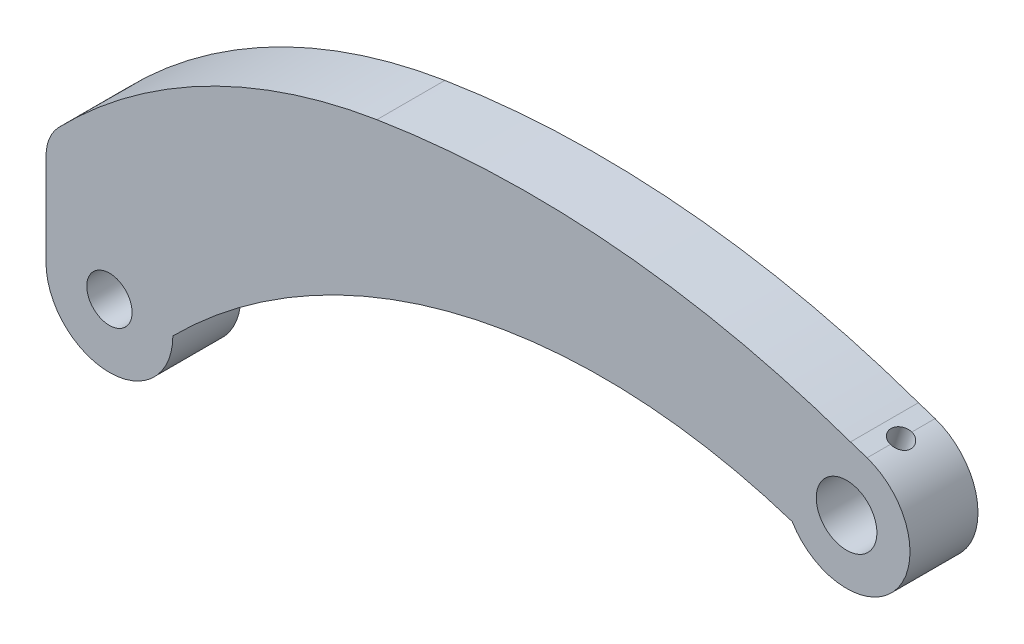
ISO-10303-21;
HEADER;
FILE_DESCRIPTION(('STEP AP214'),'2;1');
FILE_NAME('part.step','',(''),(''),'','','');
FILE_SCHEMA(('AUTOMOTIVE_DESIGN { 1 0 10303 214 1 1 1 1 }'));
ENDSEC;
DATA;
#1=APPLICATION_CONTEXT('core data for automotive mechanical design processes');
#2=APPLICATION_PROTOCOL_DEFINITION('international standard','automotive_design',2000,#1);
#3=PRODUCT_CONTEXT('',#1,'mechanical');
#4=PRODUCT('Part','Part','',(#3));
#5=PRODUCT_RELATED_PRODUCT_CATEGORY('part','',(#4));
#6=PRODUCT_DEFINITION_FORMATION('','',#4);
#7=PRODUCT_DEFINITION_CONTEXT('part definition',#1,'design');
#8=PRODUCT_DEFINITION('design','',#6,#7);
#9=PRODUCT_DEFINITION_SHAPE('','',#8);
#10=(LENGTH_UNIT() NAMED_UNIT(*) SI_UNIT(.MILLI.,.METRE.));
#11=(NAMED_UNIT(*) PLANE_ANGLE_UNIT() SI_UNIT($,.RADIAN.));
#12=(NAMED_UNIT(*) SI_UNIT($,.STERADIAN.) SOLID_ANGLE_UNIT());
#13=UNCERTAINTY_MEASURE_WITH_UNIT(LENGTH_MEASURE(1.E-05),#10,'distance_accuracy_value','');
#14=(GEOMETRIC_REPRESENTATION_CONTEXT(3) GLOBAL_UNCERTAINTY_ASSIGNED_CONTEXT((#13)) GLOBAL_UNIT_ASSIGNED_CONTEXT((#10,
#11,#12)) REPRESENTATION_CONTEXT('',''));
#15=CARTESIAN_POINT('',(0.,0.,0.));
#16=DIRECTION('',(0.,0.,1.));
#17=DIRECTION('',(1.,0.,0.));
#18=AXIS2_PLACEMENT_3D('',#15,#16,#17);
#19=CARTESIAN_POINT('',(23.7460808958069,-140.29031019522,0.));
#20=DIRECTION('',(0.309317373994585,0.950958864591468,0.));
#21=DIRECTION('',(-0.950958864591468,0.309317373994585,0.));
#22=AXIS2_PLACEMENT_3D('',#19,#20,#21);
#23=CYLINDRICAL_SURFACE('',#22,1.5);
#24=CARTESIAN_POINT('',(47.3285287994342,-67.7889256363516,-1.50000000000001));
#25=CARTESIAN_POINT('',(47.3682303350276,-67.8025109764546,-1.50000006487762));
#26=CARTESIAN_POINT('',(47.407815026627,-67.8163742276622,-1.49823853545064));
#27=CARTESIAN_POINT('',(47.4865049498814,-67.8445538739273,-1.4912156476978));
#28=CARTESIAN_POINT('',(47.5256102334144,-67.858870219343,-1.48595467152234));
#29=CARTESIAN_POINT('',(47.6416818857849,-67.9022860648032,-1.46498764472187));
#30=CARTESIAN_POINT('',(47.7175798313425,-67.9319126898596,-1.44409726018458));
#31=CARTESIAN_POINT('',(47.8642977383525,-67.9914094850627,-1.38912726676771));
#32=CARTESIAN_POINT('',(47.9351167127341,-68.0212797013005,-1.35504510232548));
#33=CARTESIAN_POINT('',(48.0699157365782,-68.0800420108765,-1.27468467640612));
#34=CARTESIAN_POINT('',(48.1338958356743,-68.1089341113124,-1.22840650345083));
#35=CARTESIAN_POINT('',(48.2540301234609,-68.1647096546514,-1.1244461105386));
#36=CARTESIAN_POINT('',(48.310104390702,-68.1915714640551,-1.0666599603315));
#37=CARTESIAN_POINT('',(48.4123779747691,-68.2416765290343,-0.941521687238114));
#38=CARTESIAN_POINT('',(48.4585736556197,-68.264918451399,-0.87416605727798));
#39=CARTESIAN_POINT('',(48.5401818677253,-68.3066716751952,-0.731334637767884));
#40=CARTESIAN_POINT('',(48.575531128758,-68.3251551220711,-0.655814553246331));
#41=CARTESIAN_POINT('',(48.6341592037986,-68.3561475225576,-0.499147850276304));
#42=CARTESIAN_POINT('',(48.6574526841618,-68.3686637340875,-0.418008205220719));
#43=CARTESIAN_POINT('',(48.6856927824057,-68.3839164821985,-0.280346828970182));
#44=CARTESIAN_POINT('',(48.6941753103415,-68.3885265207487,-0.224726146877583));
#45=CARTESIAN_POINT('',(48.7055011950289,-68.3946908619929,-0.112744995411297));
#46=CARTESIAN_POINT('',(48.708344532282,-68.3962451541212,-0.0563845234803314));
#47=CARTESIAN_POINT('',(48.7083395704175,-68.3962405159085,0.0834528182910066));
#48=CARTESIAN_POINT('',(48.7021036248019,-68.3928288257399,0.166958323797287));
#49=CARTESIAN_POINT('',(48.6773057895622,-68.3793749135364,0.331627661046964));
#50=CARTESIAN_POINT('',(48.6587310571263,-68.3693257829915,0.412788960883568));
#51=CARTESIAN_POINT('',(48.6097523674377,-68.3431987928795,0.570347921744325));
#52=CARTESIAN_POINT('',(48.579360003667,-68.3271268424538,0.646750166591005));
#53=CARTESIAN_POINT('',(48.5075019414559,-68.2898540707275,0.792775696202058));
#54=CARTESIAN_POINT('',(48.4660374733196,-68.2686538192953,0.862399732971478));
#55=CARTESIAN_POINT('',(48.3725243834121,-68.2219893176989,0.993724360458435));
#56=CARTESIAN_POINT('',(48.3203684642384,-68.1964823438438,1.05533336788289));
#57=CARTESIAN_POINT('',(48.2069835359328,-68.1426365637745,1.16809131398349));
#58=CARTESIAN_POINT('',(48.145753462535,-68.1142974255159,1.21923902402524));
#59=CARTESIAN_POINT('',(48.0151352902676,-68.055856770622,1.31004787790878));
#60=CARTESIAN_POINT('',(47.9456803363228,-68.0257419742562,1.34960431817512));
#61=CARTESIAN_POINT('',(47.8008394471054,-67.9653102564583,1.41543948885238));
#62=CARTESIAN_POINT('',(47.7254571572697,-67.9349934695955,1.44172630767256));
#63=CARTESIAN_POINT('',(47.596159264718,-67.8851401055726,1.47392851591902));
#64=CARTESIAN_POINT('',(47.5432802823712,-67.8653187376171,1.4836940444565));
#65=CARTESIAN_POINT('',(47.4365133395402,-67.8264644383593,1.49673100998773));
#66=CARTESIAN_POINT('',(47.3826266037633,-67.8074306302167,1.50000987049479));
#67=CARTESIAN_POINT('',(47.3285287994342,-67.7889256363516,1.5));
#68=B_SPLINE_CURVE_WITH_KNOTS('',3,(#24,#25,#26,#27,#28,#29,#30,#31,#32,#33,#34,#35,#36,#37,#38,
#39,#40,#41,#42,#43,#44,#45,#46,#47,#48,#49,#50,#51,#52,#53,#54,#55,#56,#57,#58,#59,#60,#61,#62,
#63,#64,#65,#66,#67),.UNSPECIFIED.,.F.,.F.,(4,2,2,2,2,2,2,2,2,2,2,2,2,2,2,2,2,2,2,2,2,4),(0.,
0.125806112671936,0.251598489182454,0.502632917958275,0.75371600245503,1.00479726457451,
1.25825827432157,1.51181241457591,1.76681865881192,2.02151394387584,2.19052675558006,
2.35954015167561,2.60969113926049,2.86010290503284,3.11026962598924,3.36040856061384,
3.61319289420979,3.86600689921312,4.12103874593439,4.37591495141606,4.54748626685377,
4.71886111772352),.UNSPECIFIED.);
#69=CARTESIAN_POINT('',(47.3285287994342,-67.7889256363516,-1.50000000000001));
#70=VERTEX_POINT('',#69);
#71=CARTESIAN_POINT('',(47.3285287994342,-67.7889256363516,1.5));
#72=VERTEX_POINT('',#71);
#73=EDGE_CURVE('E179',#70,#72,#68,.T.);
#74=ORIENTED_EDGE('',*,*,#73,.F.);
#75=CARTESIAN_POINT('',(47.3285287994342,-67.7889256363516,0.));
#76=DIRECTION('',(0.309317373994585,0.950958864591468,0.));
#77=DIRECTION('',(-0.950958864591468,0.309317373994585,0.));
#78=AXIS2_PLACEMENT_3D('',#75,#76,#77);
#79=CIRCLE('',#78,1.5);
#80=EDGE_CURVE('E194',#70,#72,#79,.T.);
#81=ORIENTED_EDGE('',*,*,#80,.T.);
#82=EDGE_LOOP('',(#74,#81));
#83=FACE_BOUND('',#82,.T.);
#84=CARTESIAN_POINT('',(44.3976002168387,-71.9503230401918,0.));
#85=CARTESIAN_POINT('',(44.3976059364193,-71.95032060843,-0.0818651420816196));
#86=CARTESIAN_POINT('',(44.4047150701796,-71.9502168495289,-0.163809287220281));
#87=CARTESIAN_POINT('',(44.43283987386,-71.9500125310232,-0.32535242406495));
#88=CARTESIAN_POINT('',(44.4538777242298,-71.9499119767899,-0.404947463476986));
#89=CARTESIAN_POINT('',(44.5088579364115,-71.9503195399592,-0.559315765857533));
#90=CARTESIAN_POINT('',(44.542768784358,-71.9508261774023,-0.6341002865423));
#91=CARTESIAN_POINT('',(44.6221718074983,-71.9533038562512,-0.77718459908814));
#92=CARTESIAN_POINT('',(44.6676632011694,-71.9552747988544,-0.845484828120138));
#93=CARTESIAN_POINT('',(44.770414449889,-71.9617731841159,-0.976209120917623));
#94=CARTESIAN_POINT('',(44.8280180566089,-71.9663842136279,-1.03835901038345));
#95=CARTESIAN_POINT('',(44.9521699970178,-71.9793110255312,-1.15253809441201));
#96=CARTESIAN_POINT('',(45.0187198214851,-71.9876274259131,-1.20456559865866));
#97=CARTESIAN_POINT('',(45.1601192579471,-72.0091248590779,-1.29796668245568));
#98=CARTESIAN_POINT('',(45.2351041337644,-72.0223965761226,-1.33911555513279));
#99=CARTESIAN_POINT('',(45.3898791457337,-72.0544770463956,-1.40804856316677));
#100=CARTESIAN_POINT('',(45.4696677024725,-72.0732839875081,-1.43583706459888));
#101=CARTESIAN_POINT('',(45.6281350599184,-72.1157675728921,-1.47620871914781));
#102=CARTESIAN_POINT('',(45.7067303520974,-72.1392190515138,-1.48935620779978));
#103=CARTESIAN_POINT('',(45.8633808810556,-72.1910531956163,-1.50194565091002));
#104=CARTESIAN_POINT('',(45.9414362364508,-72.2194347397922,-1.50139071783501));
#105=CARTESIAN_POINT('',(46.0918627301247,-72.2791447704174,-1.48695005525379));
#106=CARTESIAN_POINT('',(46.1643373326083,-72.3103309245278,-1.47354350574007));
#107=CARTESIAN_POINT('',(46.3047335908104,-72.375284281791,-1.43464517782748));
#108=CARTESIAN_POINT('',(46.3726547314223,-72.4090517760341,-1.40915203476713));
#109=CARTESIAN_POINT('',(46.5040155317334,-72.4785520149796,-1.34620644933627));
#110=CARTESIAN_POINT('',(46.5673120509666,-72.5143123104898,-1.30848659878962));
#111=CARTESIAN_POINT('',(46.6864711535024,-72.5853745582881,-1.22237918566442));
#112=CARTESIAN_POINT('',(46.7423315547846,-72.6206763733116,-1.1739885029026));
#113=CARTESIAN_POINT('',(46.8486908497813,-72.6910007385329,-1.064687135295));
#114=CARTESIAN_POINT('',(46.8987070247474,-72.7258942791514,-1.00322265686307));
#115=CARTESIAN_POINT('',(46.9886772165744,-72.791083241501,-0.871099585935352));
#116=CARTESIAN_POINT('',(47.028626009379,-72.8213762727595,-0.80043624879112));
#117=CARTESIAN_POINT('',(47.0981330825732,-72.8755654782016,-0.650633704702185));
#118=CARTESIAN_POINT('',(47.1275483292776,-72.8993726157647,-0.571395554281766));
#119=CARTESIAN_POINT('',(47.1744564875867,-72.937979757231,-0.407497109996783));
#120=CARTESIAN_POINT('',(47.1919771050053,-72.9528006837781,-0.322849922397457));
#121=CARTESIAN_POINT('',(47.2084588768708,-72.9668218407131,-0.197797675730206));
#122=CARTESIAN_POINT('',(47.2123309328916,-72.9701332200679,-0.158418004829951));
#123=CARTESIAN_POINT('',(47.2175001216244,-72.9745613243914,-0.0793656626350794));
#124=CARTESIAN_POINT('',(47.218797229838,-72.9756780284796,-0.0396929885563762));
#125=CARTESIAN_POINT('',(47.2187923616012,-72.9756692780734,0.0806021100294708));
#126=CARTESIAN_POINT('',(47.2134338597944,-72.9710467880678,0.161287986658209));
#127=CARTESIAN_POINT('',(47.1921403759286,-72.9529473210158,0.320311209857229));
#128=CARTESIAN_POINT('',(47.1761873275122,-72.9394552194565,0.398644305440923));
#129=CARTESIAN_POINT('',(47.1341943767376,-72.9048015075929,0.550479416556436));
#130=CARTESIAN_POINT('',(47.108186478963,-72.8836642454548,0.623995903680063));
#131=CARTESIAN_POINT('',(47.0466517780617,-72.8352673597491,0.764721566500378));
#132=CARTESIAN_POINT('',(47.0111253135239,-72.8080079539604,0.831930966434285));
#133=CARTESIAN_POINT('',(46.9292696487013,-72.7476934303814,0.961647357456819));
#134=CARTESIAN_POINT('',(46.8825111492978,-72.7144261091437,1.02378479814772));
#135=CARTESIAN_POINT('',(46.779946121366,-72.6450482895027,1.13825676621373));
#136=CARTESIAN_POINT('',(46.7241369181908,-72.6089369522687,1.19058838590739));
#137=CARTESIAN_POINT('',(46.6018654848755,-72.534306853469,1.28608003414213));
#138=CARTESIAN_POINT('',(46.5350578947081,-72.4957503159395,1.32877071050634));
#139=CARTESIAN_POINT('',(46.3939506548164,-72.4197931162786,1.40069039597706));
#140=CARTESIAN_POINT('',(46.3196530741916,-72.382392138635,1.42992311047256));
#141=CARTESIAN_POINT('',(46.1682371481221,-72.3119571229249,1.47297304946269));
#142=CARTESIAN_POINT('',(46.0913172967648,-72.2788142124438,1.48730841522221));
#143=CARTESIAN_POINT('',(45.9344879621997,-72.2167983040378,1.50173133304813));
#144=CARTESIAN_POINT('',(45.854579543768,-72.1879238031712,1.50182391210994));
#145=CARTESIAN_POINT('',(45.6984844355325,-72.1367267028955,1.48805698553485));
#146=CARTESIAN_POINT('',(45.622318637322,-72.1141427699445,1.47491769008969));
#147=CARTESIAN_POINT('',(45.4718699308668,-72.0739429265517,1.43619844224358));
#148=CARTESIAN_POINT('',(45.3975870787741,-72.0563271641095,1.41061811929202));
#149=CARTESIAN_POINT('',(45.2527876464924,-72.0258492949518,1.34771725832351));
#150=CARTESIAN_POINT('',(45.1822871977569,-72.0130063475389,1.3103504920729));
#151=CARTESIAN_POINT('',(45.0473297877633,-71.9916307254425,1.22498881144666));
#152=CARTESIAN_POINT('',(44.9828741213594,-71.9830989725512,1.17699162729517));
#153=CARTESIAN_POINT('',(44.8588923426785,-71.9692336200986,1.06907232273031));
#154=CARTESIAN_POINT('',(44.7997451794869,-71.964070953022,1.00869248348592));
#155=CARTESIAN_POINT('',(44.6918313831941,-71.9565400840731,0.879069169113059));
#156=CARTESIAN_POINT('',(44.6430700855593,-71.9541733156959,0.809821167306805));
#157=CARTESIAN_POINT('',(44.5566804326529,-71.9511135727337,0.662513982636291));
#158=CARTESIAN_POINT('',(44.5193308366293,-71.9504599349689,0.584290080552327));
#159=CARTESIAN_POINT('',(44.4589524196357,-71.9499005624813,0.42259320053794));
#160=CARTESIAN_POINT('',(44.4358955177589,-71.9499933561936,0.339130872327903));
#161=CARTESIAN_POINT('',(44.4129057933538,-71.9501561675877,0.212413382454601));
#162=CARTESIAN_POINT('',(44.4071754082408,-71.95021401768,0.170141545459763));
#163=CARTESIAN_POINT('',(44.3995211317564,-71.9502980872346,0.0852536156205944));
#164=CARTESIAN_POINT('',(44.3975972379304,-71.9503243067174,0.0426375229982817));
#165=CARTESIAN_POINT('',(44.3976002168387,-71.9503230401918,0.));
#166=B_SPLINE_CURVE_WITH_KNOTS('',3,(#84,#85,#86,#87,#88,#89,#90,#91,#92,#93,#94,#95,#96,#97,
#98,#99,#100,#101,#102,#103,#104,#105,#106,#107,#108,#109,#110,#111,#112,#113,#114,#115,#116,
#117,#118,#119,#120,#121,#122,#123,#124,#125,#126,#127,#128,#129,#130,#131,#132,#133,#134,#135,
#136,#137,#138,#139,#140,#141,#142,#143,#144,#145,#146,#147,#148,#149,#150,#151,#152,#153,#154,
#155,#156,#157,#158,#159,#160,#161,#162,#163,#164,#165),.UNSPECIFIED.,.T.,.F.,(4,2,2,2,2,2,2,2,
2,2,2,2,2,2,2,2,2,2,2,2,2,2,2,2,2,2,2,2,2,2,2,2,2,2,2,2,2,2,2,2,4),(0.,0.245430915575825,
0.491253604767287,0.736478346155514,0.981686542733957,1.23512499173532,1.48860572564103,
1.74697275968677,2.005255303719,2.25319494199923,2.50107826200312,2.74006462503222,
2.9790779777322,3.22371798969747,3.46842963021246,3.72699834197821,3.98570095239956,
4.24779397754201,4.50927440299091,4.62827513155107,4.74727699230264,4.98892675017831,
5.23098964319734,5.47228831069837,5.71357839600348,5.96621068335553,6.2189177646243,
6.48208605827128,6.74518185023057,6.99878505602734,7.25229875229871,7.49272152100294,
7.73315145103347,7.974536361966,8.21597286247344,8.46886376863702,8.72188427919299,
8.98066570181906,9.23893707070948,9.36676404064512,9.49459092814897),.UNSPECIFIED.);
#167=CARTESIAN_POINT('',(44.3976002168387,-71.9503230401918,0.));
#168=VERTEX_POINT('',#167);
#169=EDGE_CURVE('E140',#168,#168,#166,.T.);
#170=ORIENTED_EDGE('',*,*,#169,.T.);
#171=EDGE_LOOP('',(#170));
#172=FACE_BOUND('',#171,.T.);
#173=ADVANCED_FACE('F16',(#83,#172),#23,.F.);
#174=CARTESIAN_POINT('',(-30.6719542333047,-74.7945228686604,4.765));
#175=DIRECTION('',(0.,0.,1.));
#176=DIRECTION('',(1.,0.,0.));
#177=AXIS2_PLACEMENT_3D('',#174,#175,#176);
#178=PLANE('',#177);
#179=CARTESIAN_POINT('',(-58.8642459320123,-101.636771367044,4.765));
#180=DIRECTION('',(0.,0.,1.));
#181=DIRECTION('',(1.,0.,0.));
#182=AXIS2_PLACEMENT_3D('',#179,#180,#181);
#183=CIRCLE('',#182,3.175);
#184=CARTESIAN_POINT('',(-55.6892459320123,-101.636771367044,4.765));
#185=VERTEX_POINT('',#184);
#186=EDGE_CURVE('E137',#185,#185,#183,.F.);
#187=ORIENTED_EDGE('',*,*,#186,.T.);
#188=EDGE_LOOP('',(#187));
#189=FACE_BOUND('',#188,.T.);
#190=CARTESIAN_POINT('',(44.45,-76.2,4.765));
#191=DIRECTION('',(0.,0.,-1.));
#192=DIRECTION('',(-1.,0.,0.));
#193=AXIS2_PLACEMENT_3D('',#190,#191,#192);
#194=CIRCLE('',#193,4.25);
#195=CARTESIAN_POINT('',(40.2,-76.2,4.765));
#196=VERTEX_POINT('',#195);
#197=EDGE_CURVE('E146',#196,#196,#194,.T.);
#198=ORIENTED_EDGE('',*,*,#197,.T.);
#199=EDGE_LOOP('',(#198));
#200=FACE_BOUND('',#199,.T.);
#201=CARTESIAN_POINT('',(44.45,-76.2,4.765));
#202=DIRECTION('',(0.,0.,-1.));
#203=DIRECTION('',(-1.,0.,0.));
#204=AXIS2_PLACEMENT_3D('',#201,#202,#203);
#205=CIRCLE('',#204,8.88999999999971);
#206=CARTESIAN_POINT('',(47.3285287994341,-67.7889256363515,4.765));
#207=VERTEX_POINT('',#206);
#208=CARTESIAN_POINT('',(36.8272711246995,-80.7745059289123,4.765));
#209=VERTEX_POINT('',#208);
#210=EDGE_CURVE('E184',#207,#209,#205,.T.);
#211=ORIENTED_EDGE('',*,*,#210,.F.);
#212=DIRECTION('',(0.950958864591468,-0.309317373994585,0.));
#213=VECTOR('',#212,1.);
#214=CARTESIAN_POINT('',(44.9932064719902,-67.0293178376839,4.765));
#215=LINE('',#214,#213);
#216=CARTESIAN_POINT('',(44.9932064719887,-67.0293178376834,4.765));
#217=VERTEX_POINT('',#216);
#218=EDGE_CURVE('E113',#207,#217,#215,.F.);
#219=ORIENTED_EDGE('',*,*,#218,.T.);
#220=CARTESIAN_POINT('',(0.17692277358146,-194.169924484433,4.765));
#221=DIRECTION('',(0.,0.,1.));
#222=DIRECTION('',(1.,0.,0.));
#223=AXIS2_PLACEMENT_3D('',#220,#221,#222);
#224=CIRCLE('',#223,134.808134558118);
#225=CARTESIAN_POINT('',(-21.3796446761808,-61.096457772156,4.765));
#226=VERTEX_POINT('',#225);
#227=EDGE_CURVE('E197',#226,#217,#224,.F.);
#228=ORIENTED_EDGE('',*,*,#227,.F.);
#229=CARTESIAN_POINT('',(-8.58720153739144,-140.067043426188,4.765));
#230=DIRECTION('',(0.,0.,-1.));
#231=DIRECTION('',(-1.,0.,0.));
#232=AXIS2_PLACEMENT_3D('',#229,#230,#231);
#233=CIRCLE('',#232,80.);
#234=CARTESIAN_POINT('',(-66.0900473799743,-84.4484968791582,4.765));
#235=VERTEX_POINT('',#234);
#236=EDGE_CURVE('E200',#235,#226,#233,.T.);
#237=ORIENTED_EDGE('',*,*,#236,.F.);
#238=CARTESIAN_POINT('',(-61.4042459320134,-88.734026576907,4.765));
#239=DIRECTION('',(0.,0.,-1.));
#240=DIRECTION('',(-1.,0.,0.));
#241=AXIS2_PLACEMENT_3D('',#238,#239,#240);
#242=CIRCLE('',#241,6.34999999999999);
#243=CARTESIAN_POINT('',(-67.7542459320133,-88.734026576907,4.765));
#244=VERTEX_POINT('',#243);
#245=EDGE_CURVE('E99',#244,#235,#242,.T.);
#246=ORIENTED_EDGE('',*,*,#245,.F.);
#247=DIRECTION('',(0.,1.,0.));
#248=VECTOR('',#247,1.);
#249=CARTESIAN_POINT('',(-67.7542459320134,-101.636771367044,4.765));
#250=LINE('',#249,#248);
#251=CARTESIAN_POINT('',(-67.7542459320131,-101.636771367044,4.765));
#252=VERTEX_POINT('',#251);
#253=EDGE_CURVE('E94',#244,#252,#250,.F.);
#254=ORIENTED_EDGE('',*,*,#253,.T.);
#255=CARTESIAN_POINT('',(-58.8642459320123,-101.636771367044,4.765));
#256=DIRECTION('',(0.,0.,-1.));
#257=DIRECTION('',(-1.,0.,0.));
#258=AXIS2_PLACEMENT_3D('',#255,#256,#257);
#259=CIRCLE('',#258,8.89000000000045);
#260=CARTESIAN_POINT('',(-49.9742459320119,-101.636771367044,4.765));
#261=VERTEX_POINT('',#260);
#262=EDGE_CURVE('E20',#261,#252,#259,.T.);
#263=ORIENTED_EDGE('',*,*,#262,.F.);
#264=CARTESIAN_POINT('',(10.3433224116952,-161.59131944027,4.76500000000001));
#265=DIRECTION('',(0.,0.,1.));
#266=DIRECTION('',(1.,0.,0.));
#267=AXIS2_PLACEMENT_3D('',#264,#265,#266);
#268=CIRCLE('',#267,85.0456164982216);
#269=EDGE_CURVE('E109',#261,#209,#268,.F.);
#270=ORIENTED_EDGE('',*,*,#269,.T.);
#271=EDGE_LOOP('',(#211,#219,#228,#237,#246,#254,#263,#270));
#272=FACE_BOUND('',#271,.T.);
#273=ADVANCED_FACE('F97',(#189,#200,#272),#178,.T.);
#274=CARTESIAN_POINT('',(-67.7542459320134,-101.636771367044,4.765));
#275=DIRECTION('',(1.,0.,0.));
#276=DIRECTION('',(0.,1.,0.));
#277=AXIS2_PLACEMENT_3D('',#274,#275,#276);
#278=PLANE('',#277);
#279=DIRECTION('',(0.,0.,-1.));
#280=VECTOR('',#279,1.);
#281=CARTESIAN_POINT('',(-67.7542459320128,-101.636771367044,4.765));
#282=LINE('',#281,#280);
#283=CARTESIAN_POINT('',(-67.7542459320131,-101.636771367044,-4.765));
#284=VERTEX_POINT('',#283);
#285=EDGE_CURVE('E91',#252,#284,#282,.T.);
#286=ORIENTED_EDGE('',*,*,#285,.F.);
#287=ORIENTED_EDGE('',*,*,#253,.F.);
#288=DIRECTION('',(0.,0.,-1.));
#289=VECTOR('',#288,1.);
#290=CARTESIAN_POINT('',(-67.7542459320134,-88.734026576907,4.765));
#291=LINE('',#290,#289);
#292=CARTESIAN_POINT('',(-67.7542459320134,-88.734026576907,-4.765));
#293=VERTEX_POINT('',#292);
#294=EDGE_CURVE('E203',#293,#244,#291,.F.);
#295=ORIENTED_EDGE('',*,*,#294,.F.);
#296=DIRECTION('',(0.,1.,0.));
#297=VECTOR('',#296,1.);
#298=CARTESIAN_POINT('',(-67.7542459320134,-74.7945228686604,-4.765));
#299=LINE('',#298,#297);
#300=EDGE_CURVE('E107',#293,#284,#299,.F.);
#301=ORIENTED_EDGE('',*,*,#300,.T.);
#302=EDGE_LOOP('',(#286,#287,#295,#301));
#303=FACE_BOUND('',#302,.T.);
#304=ADVANCED_FACE('F105',(#303),#278,.F.);
#305=CARTESIAN_POINT('',(-58.8642459320123,-101.636771367044,4.765));
#306=DIRECTION('',(0.,0.,-1.));
#307=DIRECTION('',(-1.,0.,0.));
#308=AXIS2_PLACEMENT_3D('',#305,#306,#307);
#309=CYLINDRICAL_SURFACE('',#308,8.89000000000045);
#310=ORIENTED_EDGE('',*,*,#262,.T.);
#311=ORIENTED_EDGE('',*,*,#285,.T.);
#312=CARTESIAN_POINT('',(-58.8642459320123,-101.636771367044,-4.765));
#313=DIRECTION('',(0.,0.,-1.));
#314=DIRECTION('',(-1.,0.,0.));
#315=AXIS2_PLACEMENT_3D('',#312,#313,#314);
#316=CIRCLE('',#315,8.89000000000045);
#317=CARTESIAN_POINT('',(-49.9742459320119,-101.636771367044,-4.765));
#318=VERTEX_POINT('',#317);
#319=EDGE_CURVE('E135',#284,#318,#316,.F.);
#320=ORIENTED_EDGE('',*,*,#319,.T.);
#321=DIRECTION('',(0.,0.,1.));
#322=VECTOR('',#321,1.);
#323=CARTESIAN_POINT('',(-49.9742459320119,-101.636771367044,-97.6963118584092));
#324=LINE('',#323,#322);
#325=EDGE_CURVE('E93',#318,#261,#324,.T.);
#326=ORIENTED_EDGE('',*,*,#325,.T.);
#327=EDGE_LOOP('',(#310,#311,#320,#326));
#328=FACE_BOUND('',#327,.T.);
#329=ADVANCED_FACE('F88',(#328),#309,.T.);
#330=CARTESIAN_POINT('',(10.3433224116952,-161.59131944027,-97.6963118584092));
#331=DIRECTION('',(0.,0.,1.));
#332=DIRECTION('',(1.,0.,0.));
#333=AXIS2_PLACEMENT_3D('',#330,#331,#332);
#334=CYLINDRICAL_SURFACE('',#333,85.0456164982216);
#335=DIRECTION('',(0.,0.,-1.));
#336=VECTOR('',#335,1.);
#337=CARTESIAN_POINT('',(36.8272711246993,-80.774505928912,4.765));
#338=LINE('',#337,#336);
#339=CARTESIAN_POINT('',(36.8272711246995,-80.7745059289123,-4.765));
#340=VERTEX_POINT('',#339);
#341=EDGE_CURVE('E116',#209,#340,#338,.T.);
#342=ORIENTED_EDGE('',*,*,#341,.F.);
#343=ORIENTED_EDGE('',*,*,#269,.F.);
#344=ORIENTED_EDGE('',*,*,#325,.F.);
#345=CARTESIAN_POINT('',(10.3433224116952,-161.59131944027,-4.76500000000001));
#346=DIRECTION('',(0.,0.,1.));
#347=DIRECTION('',(1.,0.,0.));
#348=AXIS2_PLACEMENT_3D('',#345,#346,#347);
#349=CIRCLE('',#348,85.0456164982216);
#350=EDGE_CURVE('E132',#318,#340,#349,.F.);
#351=ORIENTED_EDGE('',*,*,#350,.T.);
#352=EDGE_LOOP('',(#342,#343,#344,#351));
#353=FACE_BOUND('',#352,.T.);
#354=ADVANCED_FACE('F175',(#353),#334,.F.);
#355=CARTESIAN_POINT('',(44.45,-76.2,4.765));
#356=DIRECTION('',(0.,0.,-1.));
#357=DIRECTION('',(-1.,0.,0.));
#358=AXIS2_PLACEMENT_3D('',#355,#356,#357);
#359=CYLINDRICAL_SURFACE('',#358,8.88999999999971);
#360=ORIENTED_EDGE('',*,*,#341,.T.);
#361=CARTESIAN_POINT('',(44.45,-76.2,-4.765));
#362=DIRECTION('',(0.,0.,-1.));
#363=DIRECTION('',(-1.,0.,0.));
#364=AXIS2_PLACEMENT_3D('',#361,#362,#363);
#365=CIRCLE('',#364,8.88999999999971);
#366=CARTESIAN_POINT('',(47.3285287994341,-67.7889256363515,-4.765));
#367=VERTEX_POINT('',#366);
#368=EDGE_CURVE('E129',#340,#367,#365,.F.);
#369=ORIENTED_EDGE('',*,*,#368,.T.);
#370=DIRECTION('',(0.,0.,1.));
#371=VECTOR('',#370,1.);
#372=CARTESIAN_POINT('',(47.3285287994342,-67.7889256363516,-4.765));
#373=LINE('',#372,#371);
#374=EDGE_CURVE('E115',#367,#70,#373,.T.);
#375=ORIENTED_EDGE('',*,*,#374,.T.);
#376=ORIENTED_EDGE('',*,*,#73,.T.);
#377=DIRECTION('',(0.,0.,1.));
#378=VECTOR('',#377,1.);
#379=CARTESIAN_POINT('',(47.3285287994342,-67.7889256363516,-4.765));
#380=LINE('',#379,#378);
#381=EDGE_CURVE('E195',#72,#207,#380,.T.);
#382=ORIENTED_EDGE('',*,*,#381,.T.);
#383=ORIENTED_EDGE('',*,*,#210,.T.);
#384=EDGE_LOOP('',(#360,#369,#375,#376,#382,#383));
#385=FACE_BOUND('',#384,.T.);
#386=ADVANCED_FACE('F170',(#385),#359,.T.);
#387=CARTESIAN_POINT('',(44.9932064719902,-67.0293178376839,-4.765));
#388=DIRECTION('',(-0.309317373994585,-0.950958864591468,0.));
#389=DIRECTION('',(0.950958864591468,-0.309317373994585,0.));
#390=AXIS2_PLACEMENT_3D('',#387,#388,#389);
#391=PLANE('',#390);
#392=ORIENTED_EDGE('',*,*,#80,.F.);
#393=ORIENTED_EDGE('',*,*,#374,.F.);
#394=DIRECTION('',(-0.950958864591468,0.309317373994587,0.));
#395=VECTOR('',#394,1.);
#396=CARTESIAN_POINT('',(47.3285287994342,-67.7889256363516,-4.765));
#397=LINE('',#396,#395);
#398=CARTESIAN_POINT('',(44.9932064719883,-67.0293178376833,-4.765));
#399=VERTEX_POINT('',#398);
#400=EDGE_CURVE('E128',#367,#399,#397,.T.);
#401=ORIENTED_EDGE('',*,*,#400,.T.);
#402=DIRECTION('',(0.,0.,1.));
#403=VECTOR('',#402,1.);
#404=CARTESIAN_POINT('',(44.9932064719902,-67.0293178376839,-4.765));
#405=LINE('',#404,#403);
#406=EDGE_CURVE('E198',#217,#399,#405,.F.);
#407=ORIENTED_EDGE('',*,*,#406,.F.);
#408=ORIENTED_EDGE('',*,*,#218,.F.);
#409=ORIENTED_EDGE('',*,*,#381,.F.);
#410=EDGE_LOOP('',(#392,#393,#401,#407,#408,#409));
#411=FACE_BOUND('',#410,.T.);
#412=ADVANCED_FACE('F166',(#411),#391,.F.);
#413=CARTESIAN_POINT('',(0.17692277358146,-194.169924484433,-4.765));
#414=DIRECTION('',(0.,0.,1.));
#415=DIRECTION('',(1.,0.,0.));
#416=AXIS2_PLACEMENT_3D('',#413,#414,#415);
#417=CYLINDRICAL_SURFACE('',#416,134.808134558118);
#418=ORIENTED_EDGE('',*,*,#227,.T.);
#419=ORIENTED_EDGE('',*,*,#406,.T.);
#420=CARTESIAN_POINT('',(0.17692277358146,-194.169924484433,-4.765));
#421=DIRECTION('',(0.,0.,1.));
#422=DIRECTION('',(1.,0.,0.));
#423=AXIS2_PLACEMENT_3D('',#420,#421,#422);
#424=CIRCLE('',#423,134.808134558118);
#425=CARTESIAN_POINT('',(-21.3796446761808,-61.096457772156,-4.76499999999999));
#426=VERTEX_POINT('',#425);
#427=EDGE_CURVE('E125',#399,#426,#424,.T.);
#428=ORIENTED_EDGE('',*,*,#427,.T.);
#429=DIRECTION('',(0.,0.,-1.));
#430=VECTOR('',#429,1.);
#431=CARTESIAN_POINT('',(-21.3796446761808,-61.096457772156,4.765));
#432=LINE('',#431,#430);
#433=EDGE_CURVE('E201',#226,#426,#432,.T.);
#434=ORIENTED_EDGE('',*,*,#433,.F.);
#435=EDGE_LOOP('',(#418,#419,#428,#434));
#436=FACE_BOUND('',#435,.T.);
#437=ADVANCED_FACE('F162',(#436),#417,.T.);
#438=CARTESIAN_POINT('',(-8.58720153739144,-140.067043426188,4.765));
#439=DIRECTION('',(0.,0.,-1.));
#440=DIRECTION('',(-1.,0.,0.));
#441=AXIS2_PLACEMENT_3D('',#438,#439,#440);
#442=CYLINDRICAL_SURFACE('',#441,80.);
#443=ORIENTED_EDGE('',*,*,#236,.T.);
#444=ORIENTED_EDGE('',*,*,#433,.T.);
#445=CARTESIAN_POINT('',(-8.58720153739144,-140.067043426188,-4.76499999999999));
#446=DIRECTION('',(0.,0.,-1.));
#447=DIRECTION('',(-1.,0.,0.));
#448=AXIS2_PLACEMENT_3D('',#445,#446,#447);
#449=CIRCLE('',#448,80.);
#450=CARTESIAN_POINT('',(-66.0900473799743,-84.4484968791582,-4.765));
#451=VERTEX_POINT('',#450);
#452=EDGE_CURVE('E122',#426,#451,#449,.F.);
#453=ORIENTED_EDGE('',*,*,#452,.T.);
#454=DIRECTION('',(0.,0.,-1.));
#455=VECTOR('',#454,1.);
#456=CARTESIAN_POINT('',(-66.090047379974,-84.4484968791579,4.765));
#457=LINE('',#456,#455);
#458=EDGE_CURVE('E35',#235,#451,#457,.T.);
#459=ORIENTED_EDGE('',*,*,#458,.F.);
#460=EDGE_LOOP('',(#443,#444,#453,#459));
#461=FACE_BOUND('',#460,.T.);
#462=ADVANCED_FACE('F159',(#461),#442,.T.);
#463=CARTESIAN_POINT('',(-61.4042459320134,-88.734026576907,4.765));
#464=DIRECTION('',(0.,0.,-1.));
#465=DIRECTION('',(-1.,0.,0.));
#466=AXIS2_PLACEMENT_3D('',#463,#464,#465);
#467=CYLINDRICAL_SURFACE('',#466,6.34999999999999);
#468=ORIENTED_EDGE('',*,*,#245,.T.);
#469=ORIENTED_EDGE('',*,*,#458,.T.);
#470=CARTESIAN_POINT('',(-61.4042459320134,-88.734026576907,-4.765));
#471=DIRECTION('',(0.,0.,-1.));
#472=DIRECTION('',(-1.,0.,0.));
#473=AXIS2_PLACEMENT_3D('',#470,#471,#472);
#474=CIRCLE('',#473,6.34999999999999);
#475=EDGE_CURVE('E120',#451,#293,#474,.F.);
#476=ORIENTED_EDGE('',*,*,#475,.T.);
#477=ORIENTED_EDGE('',*,*,#294,.T.);
#478=EDGE_LOOP('',(#468,#469,#476,#477));
#479=FACE_BOUND('',#478,.T.);
#480=ADVANCED_FACE('F154',(#479),#467,.T.);
#481=CARTESIAN_POINT('',(44.45,-76.2,5.235));
#482=DIRECTION('',(0.,0.,-1.));
#483=DIRECTION('',(-1.,0.,0.));
#484=AXIS2_PLACEMENT_3D('',#481,#482,#483);
#485=CYLINDRICAL_SURFACE('',#484,4.25);
#486=ORIENTED_EDGE('',*,*,#197,.F.);
#487=EDGE_LOOP('',(#486));
#488=FACE_BOUND('',#487,.T.);
#489=ORIENTED_EDGE('',*,*,#169,.F.);
#490=EDGE_LOOP('',(#489));
#491=FACE_BOUND('',#490,.T.);
#492=CARTESIAN_POINT('',(44.45,-76.2,-4.765));
#493=DIRECTION('',(0.,0.,-1.));
#494=DIRECTION('',(-1.,0.,0.));
#495=AXIS2_PLACEMENT_3D('',#492,#493,#494);
#496=CIRCLE('',#495,4.25);
#497=CARTESIAN_POINT('',(40.2,-76.2,-4.765));
#498=VERTEX_POINT('',#497);
#499=EDGE_CURVE('E26',#498,#498,#496,.T.);
#500=ORIENTED_EDGE('',*,*,#499,.T.);
#501=EDGE_LOOP('',(#500));
#502=FACE_BOUND('',#501,.T.);
#503=ADVANCED_FACE('F148',(#488,#491,#502),#485,.F.);
#504=CARTESIAN_POINT('',(-58.8642459320123,-101.636771367044,-16.0221399564899));
#505=DIRECTION('',(0.,0.,1.));
#506=DIRECTION('',(1.,0.,0.));
#507=AXIS2_PLACEMENT_3D('',#504,#505,#506);
#508=CYLINDRICAL_SURFACE('',#507,3.175);
#509=ORIENTED_EDGE('',*,*,#186,.F.);
#510=EDGE_LOOP('',(#509));
#511=FACE_BOUND('',#510,.T.);
#512=CARTESIAN_POINT('',(-58.8642459320123,-101.636771367044,-4.765));
#513=DIRECTION('',(0.,0.,1.));
#514=DIRECTION('',(1.,0.,0.));
#515=AXIS2_PLACEMENT_3D('',#512,#513,#514);
#516=CIRCLE('',#515,3.175);
#517=CARTESIAN_POINT('',(-55.6892459320123,-101.636771367044,-4.765));
#518=VERTEX_POINT('',#517);
#519=EDGE_CURVE('E11',#518,#518,#516,.F.);
#520=ORIENTED_EDGE('',*,*,#519,.T.);
#521=EDGE_LOOP('',(#520));
#522=FACE_BOUND('',#521,.T.);
#523=ADVANCED_FACE('F153',(#511,#522),#508,.F.);
#524=CARTESIAN_POINT('',(-30.6719542333047,-74.7945228686604,-4.765));
#525=DIRECTION('',(0.,0.,1.));
#526=DIRECTION('',(1.,0.,0.));
#527=AXIS2_PLACEMENT_3D('',#524,#525,#526);
#528=PLANE('',#527);
#529=ORIENTED_EDGE('',*,*,#519,.F.);
#530=EDGE_LOOP('',(#529));
#531=FACE_BOUND('',#530,.T.);
#532=ORIENTED_EDGE('',*,*,#499,.F.);
#533=EDGE_LOOP('',(#532));
#534=FACE_BOUND('',#533,.T.);
#535=ORIENTED_EDGE('',*,*,#452,.F.);
#536=ORIENTED_EDGE('',*,*,#427,.F.);
#537=ORIENTED_EDGE('',*,*,#400,.F.);
#538=ORIENTED_EDGE('',*,*,#368,.F.);
#539=ORIENTED_EDGE('',*,*,#350,.F.);
#540=ORIENTED_EDGE('',*,*,#319,.F.);
#541=ORIENTED_EDGE('',*,*,#300,.F.);
#542=ORIENTED_EDGE('',*,*,#475,.F.);
#543=EDGE_LOOP('',(#535,#536,#537,#538,#539,#540,#541,#542));
#544=FACE_BOUND('',#543,.T.);
#545=ADVANCED_FACE('F214',(#531,#534,#544),#528,.F.);
#546=CLOSED_SHELL('',(#173,#273,#304,#329,#354,#386,#412,#437,#462,#480,#503,#523,#545));
#547=MANIFOLD_SOLID_BREP('B1',#546);
#548=ADVANCED_BREP_SHAPE_REPRESENTATION('',(#18,#547),#14);
#549=SHAPE_DEFINITION_REPRESENTATION(#9,#548);
ENDSEC;
END-ISO-10303-21;
